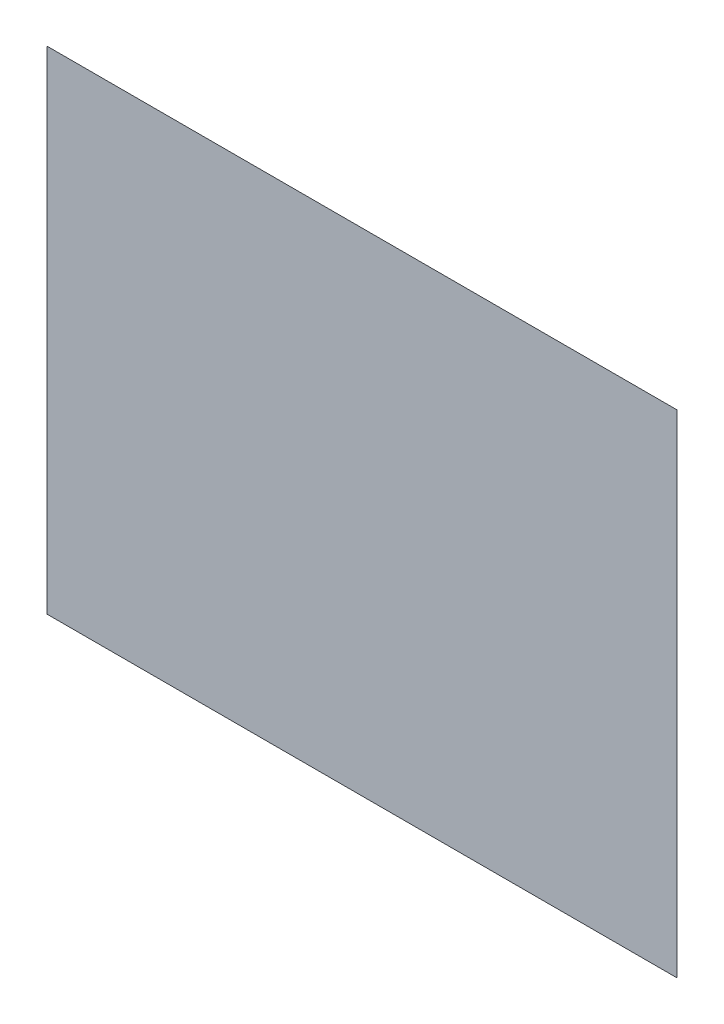
ISO-10303-21;
HEADER;
FILE_DESCRIPTION(('STEP AP214'),'2;1');
FILE_NAME('part.step','',(''),(''),'','','');
FILE_SCHEMA(('AUTOMOTIVE_DESIGN { 1 0 10303 214 1 1 1 1 }'));
ENDSEC;
DATA;
#1=APPLICATION_CONTEXT('core data for automotive mechanical design processes');
#2=APPLICATION_PROTOCOL_DEFINITION('international standard','automotive_design',2000,#1);
#3=PRODUCT_CONTEXT('',#1,'mechanical');
#4=PRODUCT('Part','Part','',(#3));
#5=PRODUCT_RELATED_PRODUCT_CATEGORY('part','',(#4));
#6=PRODUCT_DEFINITION_FORMATION('','',#4);
#7=PRODUCT_DEFINITION_CONTEXT('part definition',#1,'design');
#8=PRODUCT_DEFINITION('design','',#6,#7);
#9=PRODUCT_DEFINITION_SHAPE('','',#8);
#10=(LENGTH_UNIT() NAMED_UNIT(*) SI_UNIT(.MILLI.,.METRE.));
#11=(NAMED_UNIT(*) PLANE_ANGLE_UNIT() SI_UNIT($,.RADIAN.));
#12=(NAMED_UNIT(*) SI_UNIT($,.STERADIAN.) SOLID_ANGLE_UNIT());
#13=UNCERTAINTY_MEASURE_WITH_UNIT(LENGTH_MEASURE(1.E-05),#10,'distance_accuracy_value','');
#14=(GEOMETRIC_REPRESENTATION_CONTEXT(3) GLOBAL_UNCERTAINTY_ASSIGNED_CONTEXT((#13)) GLOBAL_UNIT_ASSIGNED_CONTEXT((#10,
#11,#12)) REPRESENTATION_CONTEXT('',''));
#15=CARTESIAN_POINT('',(0.,0.,0.));
#16=DIRECTION('',(0.,0.,1.));
#17=DIRECTION('',(1.,0.,0.));
#18=AXIS2_PLACEMENT_3D('',#15,#16,#17);
#19=CARTESIAN_POINT('',(0.,0.,0.));
#20=DIRECTION('',(0.,0.,1.));
#21=DIRECTION('',(1.,0.,0.));
#22=AXIS2_PLACEMENT_3D('',#19,#20,#21);
#23=PLANE('',#22);
#24=DIRECTION('',(0.,-1.,0.));
#25=VECTOR('',#24,1.);
#26=CARTESIAN_POINT('',(-22.49560366724,126.39617963739,0.));
#27=LINE('',#26,#25);
#28=CARTESIAN_POINT('',(-22.49560366724,126.39617963739,0.));
#29=VERTEX_POINT('',#28);
#30=CARTESIAN_POINT('',(-22.49560366724,1.39617963738999,0.));
#31=VERTEX_POINT('',#30);
#32=EDGE_CURVE('E171',#29,#31,#27,.T.);
#33=ORIENTED_EDGE('',*,*,#32,.F.);
#34=DIRECTION('',(-1.,0.,0.));
#35=VECTOR('',#34,1.);
#36=CARTESIAN_POINT('',(-22.49560366724,126.39617963739,0.));
#37=LINE('',#36,#35);
#38=CARTESIAN_POINT('',(112.50439633276,126.39617963739,0.));
#39=VERTEX_POINT('',#38);
#40=EDGE_CURVE('E12',#39,#29,#37,.T.);
#41=ORIENTED_EDGE('',*,*,#40,.F.);
#42=DIRECTION('',(0.,1.,0.));
#43=VECTOR('',#42,1.);
#44=CARTESIAN_POINT('',(112.50439633276,126.39617963739,0.));
#45=LINE('',#44,#43);
#46=CARTESIAN_POINT('',(112.50439633276,1.39617963738999,0.));
#47=VERTEX_POINT('',#46);
#48=EDGE_CURVE('E53',#47,#39,#45,.T.);
#49=ORIENTED_EDGE('',*,*,#48,.F.);
#50=DIRECTION('',(1.,0.,0.));
#51=VECTOR('',#50,1.);
#52=CARTESIAN_POINT('',(-22.49560366724,1.39617963738999,0.));
#53=LINE('',#52,#51);
#54=EDGE_CURVE('E61',#31,#47,#53,.T.);
#55=ORIENTED_EDGE('',*,*,#54,.F.);
#56=EDGE_LOOP('',(#33,#41,#49,#55));
#57=FACE_BOUND('',#56,.T.);
#58=ADVANCED_FACE('F43',(#57),#23,.F.);
#59=CARTESIAN_POINT('',(0.,0.,100.));
#60=DIRECTION('',(0.,0.,1.));
#61=DIRECTION('',(1.,0.,0.));
#62=AXIS2_PLACEMENT_3D('',#59,#60,#61);
#63=PLANE('',#62);
#64=DIRECTION('',(0.,-1.,0.));
#65=VECTOR('',#64,1.);
#66=CARTESIAN_POINT('',(-122.49560366724,226.39617963739,100.));
#67=LINE('',#66,#65);
#68=CARTESIAN_POINT('',(-122.49560366724,226.39617963739,100.));
#69=VERTEX_POINT('',#68);
#70=CARTESIAN_POINT('',(-122.49560366724,-35.00382036261,100.));
#71=VERTEX_POINT('',#70);
#72=EDGE_CURVE('E93',#69,#71,#67,.T.);
#73=ORIENTED_EDGE('',*,*,#72,.T.);
#74=DIRECTION('',(1.,0.,0.));
#75=VECTOR('',#74,1.);
#76=CARTESIAN_POINT('',(-122.49560366724,-35.00382036261,100.));
#77=LINE('',#76,#75);
#78=CARTESIAN_POINT('',(212.50439633276,-35.00382036261,100.));
#79=VERTEX_POINT('',#78);
#80=EDGE_CURVE('E112',#71,#79,#77,.T.);
#81=ORIENTED_EDGE('',*,*,#80,.T.);
#82=DIRECTION('',(0.,1.,0.));
#83=VECTOR('',#82,1.);
#84=CARTESIAN_POINT('',(212.50439633276,226.39617963739,100.));
#85=LINE('',#84,#83);
#86=CARTESIAN_POINT('',(212.50439633276,226.39617963739,100.));
#87=VERTEX_POINT('',#86);
#88=EDGE_CURVE('E95',#79,#87,#85,.T.);
#89=ORIENTED_EDGE('',*,*,#88,.T.);
#90=DIRECTION('',(-1.,0.,0.));
#91=VECTOR('',#90,1.);
#92=CARTESIAN_POINT('',(-122.49560366724,226.39617963739,100.));
#93=LINE('',#92,#91);
#94=EDGE_CURVE('E88',#87,#69,#93,.T.);
#95=ORIENTED_EDGE('',*,*,#94,.T.);
#96=EDGE_LOOP('',(#73,#81,#89,#95));
#97=FACE_BOUND('',#96,.T.);
#98=ADVANCED_FACE('F91',(#97),#63,.T.);
#99=CARTESIAN_POINT('',(0.,63.198089818695,-63.198089818695));
#100=DIRECTION('',(0.,-0.707106781186547,0.707106781186547));
#101=DIRECTION('',(0.,-0.707106781186548,-0.707106781186548));
#102=AXIS2_PLACEMENT_3D('',#99,#100,#101);
#103=PLANE('',#102);
#104=DIRECTION('',(-0.577350269189626,-0.577350269189626,-0.577350269189626));
#105=VECTOR('',#104,1.);
#106=CARTESIAN_POINT('',(212.50439633276,226.39617963739,100.));
#107=LINE('',#106,#105);
#108=EDGE_CURVE('E101',#87,#39,#107,.T.);
#109=ORIENTED_EDGE('',*,*,#108,.T.);
#110=ORIENTED_EDGE('',*,*,#40,.T.);
#111=DIRECTION('',(0.577350269189626,-0.577350269189626,-0.577350269189626));
#112=VECTOR('',#111,1.);
#113=CARTESIAN_POINT('',(-122.49560366724,226.39617963739,100.));
#114=LINE('',#113,#112);
#115=EDGE_CURVE('E109',#69,#29,#114,.T.);
#116=ORIENTED_EDGE('',*,*,#115,.F.);
#117=ORIENTED_EDGE('',*,*,#94,.F.);
#118=EDGE_LOOP('',(#109,#110,#116,#117));
#119=FACE_BOUND('',#118,.T.);
#120=ADVANCED_FACE('F116',(#119),#103,.F.);
#121=CARTESIAN_POINT('',(-11.24780183362,0.,-11.24780183362));
#122=DIRECTION('',(-0.707106781186548,0.,-0.707106781186548));
#123=DIRECTION('',(-0.707106781186548,0.,0.707106781186548));
#124=AXIS2_PLACEMENT_3D('',#121,#122,#123);
#125=PLANE('',#124);
#126=ORIENTED_EDGE('',*,*,#115,.T.);
#127=ORIENTED_EDGE('',*,*,#32,.T.);
#128=DIRECTION('',(0.684787599637451,0.249262686268032,-0.684787599637451));
#129=VECTOR('',#128,1.);
#130=CARTESIAN_POINT('',(-122.49560366724,-35.00382036261,100.));
#131=LINE('',#130,#129);
#132=EDGE_CURVE('E111',#71,#31,#131,.T.);
#133=ORIENTED_EDGE('',*,*,#132,.F.);
#134=ORIENTED_EDGE('',*,*,#72,.F.);
#135=EDGE_LOOP('',(#126,#127,#133,#134));
#136=FACE_BOUND('',#135,.T.);
#137=ADVANCED_FACE('F108',(#136),#125,.T.);
#138=CARTESIAN_POINT('',(56.25219816638,0.,-56.25219816638));
#139=DIRECTION('',(0.707106781186547,0.,-0.707106781186548));
#140=DIRECTION('',(-0.707106781186548,0.,-0.707106781186547));
#141=AXIS2_PLACEMENT_3D('',#138,#139,#140);
#142=PLANE('',#141);
#143=DIRECTION('',(-0.684787599637451,0.249262686268032,-0.684787599637451));
#144=VECTOR('',#143,1.);
#145=CARTESIAN_POINT('',(212.50439633276,-35.00382036261,100.));
#146=LINE('',#145,#144);
#147=EDGE_CURVE('E118',#79,#47,#146,.T.);
#148=ORIENTED_EDGE('',*,*,#147,.T.);
#149=ORIENTED_EDGE('',*,*,#48,.T.);
#150=ORIENTED_EDGE('',*,*,#108,.F.);
#151=ORIENTED_EDGE('',*,*,#88,.F.);
#152=EDGE_LOOP('',(#148,#149,#150,#151));
#153=FACE_BOUND('',#152,.T.);
#154=ADVANCED_FACE('F135',(#153),#142,.T.);
#155=CARTESIAN_POINT('',(0.,1.23283405627039,0.44875159648242));
#156=DIRECTION('',(0.,0.939683630956786,0.34204484166827));
#157=DIRECTION('',(0.,-0.34204484166827,0.939683630956785));
#158=AXIS2_PLACEMENT_3D('',#155,#156,#157);
#159=PLANE('',#158);
#160=ORIENTED_EDGE('',*,*,#132,.T.);
#161=ORIENTED_EDGE('',*,*,#54,.T.);
#162=ORIENTED_EDGE('',*,*,#147,.F.);
#163=ORIENTED_EDGE('',*,*,#80,.F.);
#164=EDGE_LOOP('',(#160,#161,#162,#163));
#165=FACE_BOUND('',#164,.T.);
#166=ADVANCED_FACE('F144',(#165),#159,.F.);
#167=CLOSED_SHELL('',(#58,#98,#120,#137,#154,#166));
#168=MANIFOLD_SOLID_BREP('B2',#167);
#169=ADVANCED_BREP_SHAPE_REPRESENTATION('',(#18,#168),#14);
#170=SHAPE_DEFINITION_REPRESENTATION(#9,#169);
ENDSEC;
END-ISO-10303-21;
